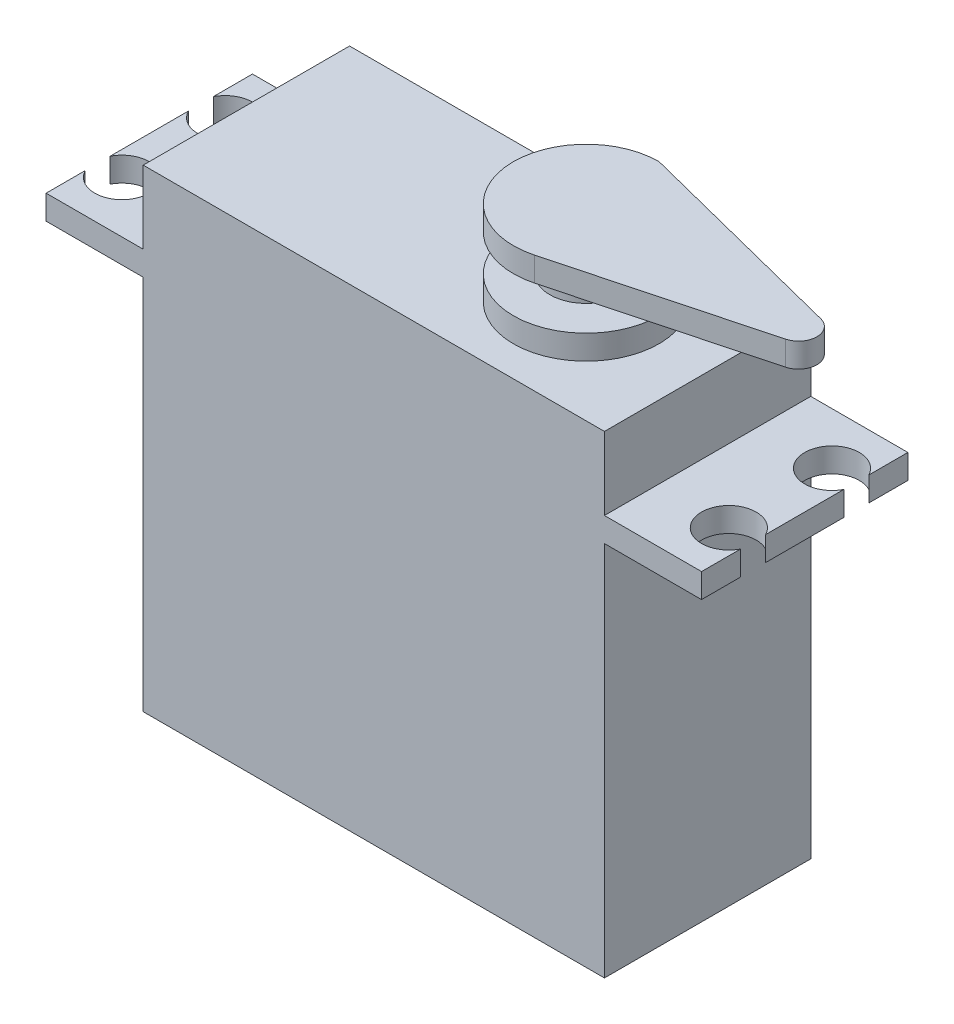
ISO-10303-21;
HEADER;
FILE_DESCRIPTION(('STEP AP214'),'2;1');
FILE_NAME('part.step','',(''),(''),'','','');
FILE_SCHEMA(('AUTOMOTIVE_DESIGN { 1 0 10303 214 1 1 1 1 }'));
ENDSEC;
DATA;
#1=APPLICATION_CONTEXT('core data for automotive mechanical design processes');
#2=APPLICATION_PROTOCOL_DEFINITION('international standard','automotive_design',2000,#1);
#3=PRODUCT_CONTEXT('',#1,'mechanical');
#4=PRODUCT('Part','Part','',(#3));
#5=PRODUCT_RELATED_PRODUCT_CATEGORY('part','',(#4));
#6=PRODUCT_DEFINITION_FORMATION('','',#4);
#7=PRODUCT_DEFINITION_CONTEXT('part definition',#1,'design');
#8=PRODUCT_DEFINITION('design','',#6,#7);
#9=PRODUCT_DEFINITION_SHAPE('','',#8);
#10=(LENGTH_UNIT() NAMED_UNIT(*) SI_UNIT(.MILLI.,.METRE.));
#11=(NAMED_UNIT(*) PLANE_ANGLE_UNIT() SI_UNIT($,.RADIAN.));
#12=(NAMED_UNIT(*) SI_UNIT($,.STERADIAN.) SOLID_ANGLE_UNIT());
#13=UNCERTAINTY_MEASURE_WITH_UNIT(LENGTH_MEASURE(1.E-05),#10,'distance_accuracy_value','');
#14=(GEOMETRIC_REPRESENTATION_CONTEXT(3) GLOBAL_UNCERTAINTY_ASSIGNED_CONTEXT((#13)) GLOBAL_UNIT_ASSIGNED_CONTEXT((#10,
#11,#12)) REPRESENTATION_CONTEXT('',''));
#15=CARTESIAN_POINT('',(0.,0.,0.));
#16=DIRECTION('',(0.,0.,1.));
#17=DIRECTION('',(1.,0.,0.));
#18=AXIS2_PLACEMENT_3D('',#15,#16,#17);
#19=CARTESIAN_POINT('',(-19.,39.,-8.5));
#20=DIRECTION('',(1.,0.,0.));
#21=DIRECTION('',(0.,0.,-1.));
#22=AXIS2_PLACEMENT_3D('',#19,#20,#21);
#23=PLANE('',#22);
#24=DIRECTION('',(0.,0.,1.));
#25=VECTOR('',#24,1.);
#26=CARTESIAN_POINT('',(-19.,31.,-8.50000000000001));
#27=LINE('',#26,#25);
#28=CARTESIAN_POINT('',(-19.,31.,-8.50000000000001));
#29=VERTEX_POINT('',#28);
#30=CARTESIAN_POINT('',(-19.,31.,8.5));
#31=VERTEX_POINT('',#30);
#32=EDGE_CURVE('E233',#29,#31,#27,.T.);
#33=ORIENTED_EDGE('',*,*,#32,.F.);
#34=DIRECTION('',(0.,-1.,0.));
#35=VECTOR('',#34,1.);
#36=CARTESIAN_POINT('',(-19.,39.,-8.5));
#37=LINE('',#36,#35);
#38=CARTESIAN_POINT('',(-19.,0.,-8.5));
#39=VERTEX_POINT('',#38);
#40=EDGE_CURVE('E353',#29,#39,#37,.T.);
#41=ORIENTED_EDGE('',*,*,#40,.T.);
#42=DIRECTION('',(0.,0.,1.));
#43=VECTOR('',#42,1.);
#44=CARTESIAN_POINT('',(-19.,0.,-8.5));
#45=LINE('',#44,#43);
#46=CARTESIAN_POINT('',(-19.,0.,8.5));
#47=VERTEX_POINT('',#46);
#48=EDGE_CURVE('E342',#39,#47,#45,.T.);
#49=ORIENTED_EDGE('',*,*,#48,.T.);
#50=DIRECTION('',(0.,-1.,0.));
#51=VECTOR('',#50,1.);
#52=CARTESIAN_POINT('',(-19.,39.,8.5));
#53=LINE('',#52,#51);
#54=EDGE_CURVE('E372',#31,#47,#53,.T.);
#55=ORIENTED_EDGE('',*,*,#54,.F.);
#56=EDGE_LOOP('',(#33,#41,#49,#55));
#57=FACE_BOUND('',#56,.T.);
#58=ADVANCED_FACE('F33',(#57),#23,.F.);
#59=CARTESIAN_POINT('',(19.,39.,-8.50000000000001));
#60=DIRECTION('',(-1.,0.,0.));
#61=DIRECTION('',(0.,0.,1.));
#62=AXIS2_PLACEMENT_3D('',#59,#60,#61);
#63=PLANE('',#62);
#64=DIRECTION('',(0.,0.,1.));
#65=VECTOR('',#64,1.);
#66=CARTESIAN_POINT('',(19.,33.,-8.50000000000001));
#67=LINE('',#66,#65);
#68=CARTESIAN_POINT('',(19.,33.,-8.50000000000001));
#69=VERTEX_POINT('',#68);
#70=CARTESIAN_POINT('',(19.,33.,8.5));
#71=VERTEX_POINT('',#70);
#72=EDGE_CURVE('E290',#69,#71,#67,.T.);
#73=ORIENTED_EDGE('',*,*,#72,.F.);
#74=DIRECTION('',(0.,-1.,0.));
#75=VECTOR('',#74,1.);
#76=CARTESIAN_POINT('',(19.,39.,-8.50000000000001));
#77=LINE('',#76,#75);
#78=CARTESIAN_POINT('',(19.,39.,-8.50000000000001));
#79=VERTEX_POINT('',#78);
#80=EDGE_CURVE('E368',#79,#69,#77,.T.);
#81=ORIENTED_EDGE('',*,*,#80,.F.);
#82=DIRECTION('',(0.,0.,-1.));
#83=VECTOR('',#82,1.);
#84=CARTESIAN_POINT('',(19.,39.,-8.50000000000001));
#85=LINE('',#84,#83);
#86=CARTESIAN_POINT('',(19.,39.,8.49999999999999));
#87=VERTEX_POINT('',#86);
#88=EDGE_CURVE('E349',#87,#79,#85,.T.);
#89=ORIENTED_EDGE('',*,*,#88,.F.);
#90=DIRECTION('',(0.,-1.,0.));
#91=VECTOR('',#90,1.);
#92=CARTESIAN_POINT('',(19.,39.,8.49999999999999));
#93=LINE('',#92,#91);
#94=EDGE_CURVE('E371',#87,#71,#93,.T.);
#95=ORIENTED_EDGE('',*,*,#94,.T.);
#96=EDGE_LOOP('',(#73,#81,#89,#95));
#97=FACE_BOUND('',#96,.T.);
#98=ADVANCED_FACE('F412',(#97),#63,.F.);
#99=CARTESIAN_POINT('',(-19.,39.,-8.5));
#100=VERTEX_POINT('',#99);
#101=CARTESIAN_POINT('',(-19.,33.,-8.50000000000001));
#102=VERTEX_POINT('',#101);
#103=EDGE_CURVE('E364',#100,#102,#37,.T.);
#104=ORIENTED_EDGE('',*,*,#103,.T.);
#105=DIRECTION('',(0.,0.,1.));
#106=VECTOR('',#105,1.);
#107=CARTESIAN_POINT('',(-19.,33.,-8.50000000000001));
#108=LINE('',#107,#106);
#109=CARTESIAN_POINT('',(-19.,33.,8.5));
#110=VERTEX_POINT('',#109);
#111=EDGE_CURVE('E236',#102,#110,#108,.T.);
#112=ORIENTED_EDGE('',*,*,#111,.T.);
#113=CARTESIAN_POINT('',(-19.,39.,8.5));
#114=VERTEX_POINT('',#113);
#115=EDGE_CURVE('E37',#114,#110,#53,.T.);
#116=ORIENTED_EDGE('',*,*,#115,.F.);
#117=DIRECTION('',(0.,0.,1.));
#118=VECTOR('',#117,1.);
#119=CARTESIAN_POINT('',(-19.,39.,-8.5));
#120=LINE('',#119,#118);
#121=EDGE_CURVE('E343',#100,#114,#120,.T.);
#122=ORIENTED_EDGE('',*,*,#121,.F.);
#123=EDGE_LOOP('',(#104,#112,#116,#122));
#124=FACE_BOUND('',#123,.T.);
#125=ADVANCED_FACE('F35',(#124),#23,.F.);
#126=CARTESIAN_POINT('',(-19.,39.,8.5));
#127=DIRECTION('',(0.,0.,-1.));
#128=DIRECTION('',(-1.,0.,0.));
#129=AXIS2_PLACEMENT_3D('',#126,#127,#128);
#130=PLANE('',#129);
#131=DIRECTION('',(1.,0.,0.));
#132=VECTOR('',#131,1.);
#133=CARTESIAN_POINT('',(-19.,0.,8.5));
#134=LINE('',#133,#132);
#135=CARTESIAN_POINT('',(19.,0.,8.49999999999999));
#136=VERTEX_POINT('',#135);
#137=EDGE_CURVE('E356',#47,#136,#134,.T.);
#138=ORIENTED_EDGE('',*,*,#137,.T.);
#139=CARTESIAN_POINT('',(19.,31.,8.49999999999999));
#140=VERTEX_POINT('',#139);
#141=EDGE_CURVE('E370',#140,#136,#93,.T.);
#142=ORIENTED_EDGE('',*,*,#141,.F.);
#143=DIRECTION('',(1.,0.,0.));
#144=VECTOR('',#143,1.);
#145=CARTESIAN_POINT('',(19.,31.,8.5));
#146=LINE('',#145,#144);
#147=CARTESIAN_POINT('',(27.,31.,8.5));
#148=VERTEX_POINT('',#147);
#149=EDGE_CURVE('E311',#140,#148,#146,.T.);
#150=ORIENTED_EDGE('',*,*,#149,.T.);
#151=DIRECTION('',(0.,-1.,0.));
#152=VECTOR('',#151,1.);
#153=CARTESIAN_POINT('',(27.,33.,8.5));
#154=LINE('',#153,#152);
#155=CARTESIAN_POINT('',(27.,33.,8.5));
#156=VERTEX_POINT('',#155);
#157=EDGE_CURVE('E339',#156,#148,#154,.T.);
#158=ORIENTED_EDGE('',*,*,#157,.F.);
#159=DIRECTION('',(1.,0.,0.));
#160=VECTOR('',#159,1.);
#161=CARTESIAN_POINT('',(19.,33.,8.5));
#162=LINE('',#161,#160);
#163=EDGE_CURVE('E293',#71,#156,#162,.T.);
#164=ORIENTED_EDGE('',*,*,#163,.F.);
#165=ORIENTED_EDGE('',*,*,#94,.F.);
#166=DIRECTION('',(1.,0.,0.));
#167=VECTOR('',#166,1.);
#168=CARTESIAN_POINT('',(-19.,39.,8.5));
#169=LINE('',#168,#167);
#170=EDGE_CURVE('E346',#114,#87,#169,.T.);
#171=ORIENTED_EDGE('',*,*,#170,.F.);
#172=ORIENTED_EDGE('',*,*,#115,.T.);
#173=DIRECTION('',(-1.,0.,0.));
#174=VECTOR('',#173,1.);
#175=CARTESIAN_POINT('',(-19.,33.,8.5));
#176=LINE('',#175,#174);
#177=CARTESIAN_POINT('',(-27.,33.,8.5));
#178=VERTEX_POINT('',#177);
#179=EDGE_CURVE('E49',#110,#178,#176,.T.);
#180=ORIENTED_EDGE('',*,*,#179,.T.);
#181=DIRECTION('',(0.,-1.,0.));
#182=VECTOR('',#181,1.);
#183=CARTESIAN_POINT('',(-27.,33.,8.5));
#184=LINE('',#183,#182);
#185=CARTESIAN_POINT('',(-27.,31.,8.5));
#186=VERTEX_POINT('',#185);
#187=EDGE_CURVE('E258',#178,#186,#184,.T.);
#188=ORIENTED_EDGE('',*,*,#187,.T.);
#189=DIRECTION('',(-1.,0.,0.));
#190=VECTOR('',#189,1.);
#191=CARTESIAN_POINT('',(-19.,31.,8.5));
#192=LINE('',#191,#190);
#193=EDGE_CURVE('E239',#31,#186,#192,.T.);
#194=ORIENTED_EDGE('',*,*,#193,.F.);
#195=ORIENTED_EDGE('',*,*,#54,.T.);
#196=EDGE_LOOP('',(#138,#142,#150,#158,#164,#165,#171,#172,#180,#188,#194,#195));
#197=FACE_BOUND('',#196,.T.);
#198=ADVANCED_FACE('F383',(#197),#130,.F.);
#199=CARTESIAN_POINT('',(19.,31.,-8.50000000000001));
#200=VERTEX_POINT('',#199);
#201=CARTESIAN_POINT('',(19.,0.,-8.50000000000001));
#202=VERTEX_POINT('',#201);
#203=EDGE_CURVE('E367',#200,#202,#77,.T.);
#204=ORIENTED_EDGE('',*,*,#203,.F.);
#205=DIRECTION('',(0.,0.,1.));
#206=VECTOR('',#205,1.);
#207=CARTESIAN_POINT('',(19.,31.,-8.50000000000001));
#208=LINE('',#207,#206);
#209=EDGE_CURVE('E57',#200,#140,#208,.T.);
#210=ORIENTED_EDGE('',*,*,#209,.T.);
#211=ORIENTED_EDGE('',*,*,#141,.T.);
#212=DIRECTION('',(0.,0.,-1.));
#213=VECTOR('',#212,1.);
#214=CARTESIAN_POINT('',(19.,0.,-8.50000000000001));
#215=LINE('',#214,#213);
#216=EDGE_CURVE('E359',#136,#202,#215,.T.);
#217=ORIENTED_EDGE('',*,*,#216,.T.);
#218=EDGE_LOOP('',(#204,#210,#211,#217));
#219=FACE_BOUND('',#218,.T.);
#220=ADVANCED_FACE('F377',(#219),#63,.F.);
#221=CARTESIAN_POINT('',(-19.,39.,-8.5));
#222=DIRECTION('',(0.,0.,1.));
#223=DIRECTION('',(1.,0.,0.));
#224=AXIS2_PLACEMENT_3D('',#221,#222,#223);
#225=PLANE('',#224);
#226=DIRECTION('',(-1.,0.,0.));
#227=VECTOR('',#226,1.);
#228=CARTESIAN_POINT('',(-19.,0.,-8.5));
#229=LINE('',#228,#227);
#230=EDGE_CURVE('E347',#202,#39,#229,.T.);
#231=ORIENTED_EDGE('',*,*,#230,.T.);
#232=ORIENTED_EDGE('',*,*,#40,.F.);
#233=DIRECTION('',(1.,0.,0.));
#234=VECTOR('',#233,1.);
#235=CARTESIAN_POINT('',(-19.,31.,-8.50000000000001));
#236=LINE('',#235,#234);
#237=CARTESIAN_POINT('',(-27.,31.,-8.50000000000001));
#238=VERTEX_POINT('',#237);
#239=EDGE_CURVE('E260',#238,#29,#236,.T.);
#240=ORIENTED_EDGE('',*,*,#239,.F.);
#241=DIRECTION('',(0.,-1.,0.));
#242=VECTOR('',#241,1.);
#243=CARTESIAN_POINT('',(-27.,33.,-8.50000000000001));
#244=LINE('',#243,#242);
#245=CARTESIAN_POINT('',(-27.,33.,-8.50000000000001));
#246=VERTEX_POINT('',#245);
#247=EDGE_CURVE('E288',#246,#238,#244,.T.);
#248=ORIENTED_EDGE('',*,*,#247,.F.);
#249=DIRECTION('',(1.,0.,0.));
#250=VECTOR('',#249,1.);
#251=CARTESIAN_POINT('',(-19.,33.,-8.50000000000001));
#252=LINE('',#251,#250);
#253=EDGE_CURVE('E238',#246,#102,#252,.T.);
#254=ORIENTED_EDGE('',*,*,#253,.T.);
#255=ORIENTED_EDGE('',*,*,#103,.F.);
#256=DIRECTION('',(-1.,0.,0.));
#257=VECTOR('',#256,1.);
#258=CARTESIAN_POINT('',(-19.,39.,-8.5));
#259=LINE('',#258,#257);
#260=EDGE_CURVE('E351',#79,#100,#259,.T.);
#261=ORIENTED_EDGE('',*,*,#260,.F.);
#262=ORIENTED_EDGE('',*,*,#80,.T.);
#263=DIRECTION('',(-1.,0.,0.));
#264=VECTOR('',#263,1.);
#265=CARTESIAN_POINT('',(19.,33.,-8.50000000000001));
#266=LINE('',#265,#264);
#267=CARTESIAN_POINT('',(27.,33.,-8.50000000000001));
#268=VERTEX_POINT('',#267);
#269=EDGE_CURVE('E306',#268,#69,#266,.T.);
#270=ORIENTED_EDGE('',*,*,#269,.F.);
#271=DIRECTION('',(0.,-1.,0.));
#272=VECTOR('',#271,1.);
#273=CARTESIAN_POINT('',(27.,33.,-8.50000000000001));
#274=LINE('',#273,#272);
#275=CARTESIAN_POINT('',(27.,31.,-8.50000000000001));
#276=VERTEX_POINT('',#275);
#277=EDGE_CURVE('E309',#268,#276,#274,.T.);
#278=ORIENTED_EDGE('',*,*,#277,.T.);
#279=DIRECTION('',(-1.,0.,0.));
#280=VECTOR('',#279,1.);
#281=CARTESIAN_POINT('',(19.,31.,-8.50000000000001));
#282=LINE('',#281,#280);
#283=EDGE_CURVE('E294',#276,#200,#282,.T.);
#284=ORIENTED_EDGE('',*,*,#283,.T.);
#285=ORIENTED_EDGE('',*,*,#203,.T.);
#286=EDGE_LOOP('',(#231,#232,#240,#248,#254,#255,#261,#262,#270,#278,#284,#285));
#287=FACE_BOUND('',#286,.T.);
#288=ADVANCED_FACE('F391',(#287),#225,.F.);
#289=CARTESIAN_POINT('',(0.,39.,0.));
#290=DIRECTION('',(0.,1.,0.));
#291=DIRECTION('',(0.,0.,1.));
#292=AXIS2_PLACEMENT_3D('',#289,#290,#291);
#293=PLANE('',#292);
#294=CARTESIAN_POINT('',(9.00000000000001,39.,0.));
#295=DIRECTION('',(0.,1.,0.));
#296=DIRECTION('',(0.,0.,1.));
#297=AXIS2_PLACEMENT_3D('',#294,#295,#296);
#298=CIRCLE('',#297,6.);
#299=CARTESIAN_POINT('',(9.00000000000001,39.,6.));
#300=VERTEX_POINT('',#299);
#301=EDGE_CURVE('E224',#300,#300,#298,.T.);
#302=ORIENTED_EDGE('',*,*,#301,.F.);
#303=EDGE_LOOP('',(#302));
#304=FACE_BOUND('',#303,.T.);
#305=ORIENTED_EDGE('',*,*,#121,.T.);
#306=ORIENTED_EDGE('',*,*,#170,.T.);
#307=ORIENTED_EDGE('',*,*,#88,.T.);
#308=ORIENTED_EDGE('',*,*,#260,.T.);
#309=EDGE_LOOP('',(#305,#306,#307,#308));
#310=FACE_BOUND('',#309,.T.);
#311=ADVANCED_FACE('F415',(#304,#310),#293,.T.);
#312=CARTESIAN_POINT('',(0.,0.,0.));
#313=DIRECTION('',(0.,1.,0.));
#314=DIRECTION('',(0.,0.,1.));
#315=AXIS2_PLACEMENT_3D('',#312,#313,#314);
#316=PLANE('',#315);
#317=ORIENTED_EDGE('',*,*,#48,.F.);
#318=ORIENTED_EDGE('',*,*,#230,.F.);
#319=ORIENTED_EDGE('',*,*,#216,.F.);
#320=ORIENTED_EDGE('',*,*,#137,.F.);
#321=EDGE_LOOP('',(#317,#318,#319,#320));
#322=FACE_BOUND('',#321,.T.);
#323=ADVANCED_FACE('F388',(#322),#316,.F.);
#324=CARTESIAN_POINT('',(27.,33.,5.2807764064044));
#325=DIRECTION('',(-1.,0.,0.));
#326=DIRECTION('',(0.,0.,1.));
#327=AXIS2_PLACEMENT_3D('',#324,#325,#326);
#328=PLANE('',#327);
#329=DIRECTION('',(0.,0.,-1.));
#330=VECTOR('',#329,1.);
#331=CARTESIAN_POINT('',(27.,31.,5.2807764064044));
#332=LINE('',#331,#330);
#333=CARTESIAN_POINT('',(27.,31.,5.2807764064044));
#334=VERTEX_POINT('',#333);
#335=EDGE_CURVE('E313',#148,#334,#332,.T.);
#336=ORIENTED_EDGE('',*,*,#335,.T.);
#337=DIRECTION('',(0.,-1.,0.));
#338=VECTOR('',#337,1.);
#339=CARTESIAN_POINT('',(27.,33.,5.2807764064044));
#340=LINE('',#339,#338);
#341=CARTESIAN_POINT('',(27.,33.,5.2807764064044));
#342=VERTEX_POINT('',#341);
#343=EDGE_CURVE('E336',#342,#334,#340,.T.);
#344=ORIENTED_EDGE('',*,*,#343,.F.);
#345=DIRECTION('',(0.,0.,-1.));
#346=VECTOR('',#345,1.);
#347=CARTESIAN_POINT('',(27.,33.,5.2807764064044));
#348=LINE('',#347,#346);
#349=EDGE_CURVE('E296',#156,#342,#348,.T.);
#350=ORIENTED_EDGE('',*,*,#349,.F.);
#351=ORIENTED_EDGE('',*,*,#157,.T.);
#352=EDGE_LOOP('',(#336,#344,#350,#351));
#353=FACE_BOUND('',#352,.T.);
#354=ADVANCED_FACE('F404',(#353),#328,.F.);
#355=CARTESIAN_POINT('',(25.,33.,4.25));
#356=DIRECTION('',(0.,-1.,0.));
#357=DIRECTION('',(0.,0.,-1.));
#358=AXIS2_PLACEMENT_3D('',#355,#356,#357);
#359=CYLINDRICAL_SURFACE('',#358,2.25);
#360=CARTESIAN_POINT('',(25.,31.,4.25));
#361=DIRECTION('',(0.,-1.,0.));
#362=DIRECTION('',(0.,0.,-1.));
#363=AXIS2_PLACEMENT_3D('',#360,#361,#362);
#364=CIRCLE('',#363,2.25);
#365=CARTESIAN_POINT('',(27.,31.,3.2192235935956));
#366=VERTEX_POINT('',#365);
#367=EDGE_CURVE('E315',#334,#366,#364,.T.);
#368=ORIENTED_EDGE('',*,*,#367,.T.);
#369=DIRECTION('',(0.,-1.,0.));
#370=VECTOR('',#369,1.);
#371=CARTESIAN_POINT('',(27.,33.,3.2192235935956));
#372=LINE('',#371,#370);
#373=CARTESIAN_POINT('',(27.,33.,3.2192235935956));
#374=VERTEX_POINT('',#373);
#375=EDGE_CURVE('E333',#374,#366,#372,.T.);
#376=ORIENTED_EDGE('',*,*,#375,.F.);
#377=CARTESIAN_POINT('',(25.,33.,4.25));
#378=DIRECTION('',(0.,-1.,0.));
#379=DIRECTION('',(0.,0.,-1.));
#380=AXIS2_PLACEMENT_3D('',#377,#378,#379);
#381=CIRCLE('',#380,2.25);
#382=EDGE_CURVE('E298',#342,#374,#381,.T.);
#383=ORIENTED_EDGE('',*,*,#382,.F.);
#384=ORIENTED_EDGE('',*,*,#343,.T.);
#385=EDGE_LOOP('',(#368,#376,#383,#384));
#386=FACE_BOUND('',#385,.T.);
#387=ADVANCED_FACE('F450',(#386),#359,.F.);
#388=CARTESIAN_POINT('',(27.,33.,-3.2192235935956));
#389=DIRECTION('',(-1.,0.,0.));
#390=DIRECTION('',(0.,0.,1.));
#391=AXIS2_PLACEMENT_3D('',#388,#389,#390);
#392=PLANE('',#391);
#393=DIRECTION('',(0.,0.,-1.));
#394=VECTOR('',#393,1.);
#395=CARTESIAN_POINT('',(27.,31.,-3.2192235935956));
#396=LINE('',#395,#394);
#397=CARTESIAN_POINT('',(27.,31.,-3.2192235935956));
#398=VERTEX_POINT('',#397);
#399=EDGE_CURVE('E317',#366,#398,#396,.T.);
#400=ORIENTED_EDGE('',*,*,#399,.T.);
#401=DIRECTION('',(0.,-1.,0.));
#402=VECTOR('',#401,1.);
#403=CARTESIAN_POINT('',(27.,33.,-3.2192235935956));
#404=LINE('',#403,#402);
#405=CARTESIAN_POINT('',(27.,33.,-3.2192235935956));
#406=VERTEX_POINT('',#405);
#407=EDGE_CURVE('E330',#406,#398,#404,.T.);
#408=ORIENTED_EDGE('',*,*,#407,.F.);
#409=DIRECTION('',(0.,0.,-1.));
#410=VECTOR('',#409,1.);
#411=CARTESIAN_POINT('',(27.,33.,-3.2192235935956));
#412=LINE('',#411,#410);
#413=EDGE_CURVE('E300',#374,#406,#412,.T.);
#414=ORIENTED_EDGE('',*,*,#413,.F.);
#415=ORIENTED_EDGE('',*,*,#375,.T.);
#416=EDGE_LOOP('',(#400,#408,#414,#415));
#417=FACE_BOUND('',#416,.T.);
#418=ADVANCED_FACE('F453',(#417),#392,.F.);
#419=CARTESIAN_POINT('',(25.,33.,-4.25));
#420=DIRECTION('',(0.,-1.,0.));
#421=DIRECTION('',(0.,0.,-1.));
#422=AXIS2_PLACEMENT_3D('',#419,#420,#421);
#423=CYLINDRICAL_SURFACE('',#422,2.25);
#424=CARTESIAN_POINT('',(25.,31.,-4.25));
#425=DIRECTION('',(0.,-1.,0.));
#426=DIRECTION('',(0.,0.,1.));
#427=AXIS2_PLACEMENT_3D('',#424,#425,#426);
#428=CIRCLE('',#427,2.25);
#429=CARTESIAN_POINT('',(27.,31.,-5.2807764064044));
#430=VERTEX_POINT('',#429);
#431=EDGE_CURVE('E319',#398,#430,#428,.T.);
#432=ORIENTED_EDGE('',*,*,#431,.T.);
#433=DIRECTION('',(0.,-1.,0.));
#434=VECTOR('',#433,1.);
#435=CARTESIAN_POINT('',(27.,33.,-5.2807764064044));
#436=LINE('',#435,#434);
#437=CARTESIAN_POINT('',(27.,33.,-5.2807764064044));
#438=VERTEX_POINT('',#437);
#439=EDGE_CURVE('E327',#438,#430,#436,.T.);
#440=ORIENTED_EDGE('',*,*,#439,.F.);
#441=CARTESIAN_POINT('',(25.,33.,-4.25));
#442=DIRECTION('',(0.,-1.,0.));
#443=DIRECTION('',(0.,0.,1.));
#444=AXIS2_PLACEMENT_3D('',#441,#442,#443);
#445=CIRCLE('',#444,2.25);
#446=EDGE_CURVE('E302',#406,#438,#445,.T.);
#447=ORIENTED_EDGE('',*,*,#446,.F.);
#448=ORIENTED_EDGE('',*,*,#407,.T.);
#449=EDGE_LOOP('',(#432,#440,#447,#448));
#450=FACE_BOUND('',#449,.T.);
#451=ADVANCED_FACE('F457',(#450),#423,.F.);
#452=CARTESIAN_POINT('',(27.,33.,-8.50000000000001));
#453=DIRECTION('',(-1.,0.,0.));
#454=DIRECTION('',(0.,0.,1.));
#455=AXIS2_PLACEMENT_3D('',#452,#453,#454);
#456=PLANE('',#455);
#457=DIRECTION('',(0.,0.,-1.));
#458=VECTOR('',#457,1.);
#459=CARTESIAN_POINT('',(27.,31.,-8.50000000000001));
#460=LINE('',#459,#458);
#461=EDGE_CURVE('E321',#430,#276,#460,.T.);
#462=ORIENTED_EDGE('',*,*,#461,.T.);
#463=ORIENTED_EDGE('',*,*,#277,.F.);
#464=DIRECTION('',(0.,0.,-1.));
#465=VECTOR('',#464,1.);
#466=CARTESIAN_POINT('',(27.,33.,-8.50000000000001));
#467=LINE('',#466,#465);
#468=EDGE_CURVE('E304',#438,#268,#467,.T.);
#469=ORIENTED_EDGE('',*,*,#468,.F.);
#470=ORIENTED_EDGE('',*,*,#439,.T.);
#471=EDGE_LOOP('',(#462,#463,#469,#470));
#472=FACE_BOUND('',#471,.T.);
#473=ADVANCED_FACE('F461',(#472),#456,.F.);
#474=CARTESIAN_POINT('',(25.,33.,4.25));
#475=DIRECTION('',(0.,-1.,0.));
#476=DIRECTION('',(0.,0.,-1.));
#477=AXIS2_PLACEMENT_3D('',#474,#475,#476);
#478=PLANE('',#477);
#479=ORIENTED_EDGE('',*,*,#72,.T.);
#480=ORIENTED_EDGE('',*,*,#163,.T.);
#481=ORIENTED_EDGE('',*,*,#349,.T.);
#482=ORIENTED_EDGE('',*,*,#382,.T.);
#483=ORIENTED_EDGE('',*,*,#413,.T.);
#484=ORIENTED_EDGE('',*,*,#446,.T.);
#485=ORIENTED_EDGE('',*,*,#468,.T.);
#486=ORIENTED_EDGE('',*,*,#269,.T.);
#487=EDGE_LOOP('',(#479,#480,#481,#482,#483,#484,#485,#486));
#488=FACE_BOUND('',#487,.T.);
#489=ADVANCED_FACE('F408',(#488),#478,.F.);
#490=CARTESIAN_POINT('',(25.,31.,4.25));
#491=DIRECTION('',(0.,-1.,0.));
#492=DIRECTION('',(0.,0.,-1.));
#493=AXIS2_PLACEMENT_3D('',#490,#491,#492);
#494=PLANE('',#493);
#495=ORIENTED_EDGE('',*,*,#209,.F.);
#496=ORIENTED_EDGE('',*,*,#283,.F.);
#497=ORIENTED_EDGE('',*,*,#461,.F.);
#498=ORIENTED_EDGE('',*,*,#431,.F.);
#499=ORIENTED_EDGE('',*,*,#399,.F.);
#500=ORIENTED_EDGE('',*,*,#367,.F.);
#501=ORIENTED_EDGE('',*,*,#335,.F.);
#502=ORIENTED_EDGE('',*,*,#149,.F.);
#503=EDGE_LOOP('',(#495,#496,#497,#498,#499,#500,#501,#502));
#504=FACE_BOUND('',#503,.T.);
#505=ADVANCED_FACE('F398',(#504),#494,.T.);
#506=CARTESIAN_POINT('',(-27.,33.,-8.50000000000001));
#507=DIRECTION('',(-1.,0.,0.));
#508=DIRECTION('',(0.,0.,1.));
#509=AXIS2_PLACEMENT_3D('',#506,#507,#508);
#510=PLANE('',#509);
#511=DIRECTION('',(0.,0.,-1.));
#512=VECTOR('',#511,1.);
#513=CARTESIAN_POINT('',(-27.,31.,-8.50000000000001));
#514=LINE('',#513,#512);
#515=CARTESIAN_POINT('',(-27.,31.,-5.2807764064044));
#516=VERTEX_POINT('',#515);
#517=EDGE_CURVE('E262',#516,#238,#514,.T.);
#518=ORIENTED_EDGE('',*,*,#517,.F.);
#519=DIRECTION('',(0.,-1.,0.));
#520=VECTOR('',#519,1.);
#521=CARTESIAN_POINT('',(-27.,33.,-5.2807764064044));
#522=LINE('',#521,#520);
#523=CARTESIAN_POINT('',(-27.,33.,-5.2807764064044));
#524=VERTEX_POINT('',#523);
#525=EDGE_CURVE('E286',#524,#516,#522,.T.);
#526=ORIENTED_EDGE('',*,*,#525,.F.);
#527=DIRECTION('',(0.,0.,-1.));
#528=VECTOR('',#527,1.);
#529=CARTESIAN_POINT('',(-27.,33.,-8.50000000000001));
#530=LINE('',#529,#528);
#531=EDGE_CURVE('E242',#524,#246,#530,.T.);
#532=ORIENTED_EDGE('',*,*,#531,.T.);
#533=ORIENTED_EDGE('',*,*,#247,.T.);
#534=EDGE_LOOP('',(#518,#526,#532,#533));
#535=FACE_BOUND('',#534,.T.);
#536=ADVANCED_FACE('F468',(#535),#510,.T.);
#537=CARTESIAN_POINT('',(-25.,33.,-4.25));
#538=DIRECTION('',(0.,-1.,0.));
#539=DIRECTION('',(0.,0.,-1.));
#540=AXIS2_PLACEMENT_3D('',#537,#538,#539);
#541=CYLINDRICAL_SURFACE('',#540,2.25);
#542=CARTESIAN_POINT('',(-25.,31.,-4.25));
#543=DIRECTION('',(0.,1.,0.));
#544=DIRECTION('',(0.,0.,1.));
#545=AXIS2_PLACEMENT_3D('',#542,#543,#544);
#546=CIRCLE('',#545,2.25);
#547=CARTESIAN_POINT('',(-27.,31.,-3.2192235935956));
#548=VERTEX_POINT('',#547);
#549=EDGE_CURVE('E265',#548,#516,#546,.T.);
#550=ORIENTED_EDGE('',*,*,#549,.F.);
#551=DIRECTION('',(0.,-1.,0.));
#552=VECTOR('',#551,1.);
#553=CARTESIAN_POINT('',(-27.,33.,-3.2192235935956));
#554=LINE('',#553,#552);
#555=CARTESIAN_POINT('',(-27.,33.,-3.2192235935956));
#556=VERTEX_POINT('',#555);
#557=EDGE_CURVE('E284',#556,#548,#554,.T.);
#558=ORIENTED_EDGE('',*,*,#557,.F.);
#559=CARTESIAN_POINT('',(-25.,33.,-4.25));
#560=DIRECTION('',(0.,1.,0.));
#561=DIRECTION('',(0.,0.,1.));
#562=AXIS2_PLACEMENT_3D('',#559,#560,#561);
#563=CIRCLE('',#562,2.25);
#564=EDGE_CURVE('E245',#556,#524,#563,.T.);
#565=ORIENTED_EDGE('',*,*,#564,.T.);
#566=ORIENTED_EDGE('',*,*,#525,.T.);
#567=EDGE_LOOP('',(#550,#558,#565,#566));
#568=FACE_BOUND('',#567,.T.);
#569=ADVANCED_FACE('F473',(#568),#541,.F.);
#570=CARTESIAN_POINT('',(-27.,33.,-3.2192235935956));
#571=DIRECTION('',(-1.,0.,0.));
#572=DIRECTION('',(0.,0.,1.));
#573=AXIS2_PLACEMENT_3D('',#570,#571,#572);
#574=PLANE('',#573);
#575=DIRECTION('',(0.,0.,-1.));
#576=VECTOR('',#575,1.);
#577=CARTESIAN_POINT('',(-27.,31.,-3.2192235935956));
#578=LINE('',#577,#576);
#579=CARTESIAN_POINT('',(-27.,31.,3.2192235935956));
#580=VERTEX_POINT('',#579);
#581=EDGE_CURVE('E268',#580,#548,#578,.T.);
#582=ORIENTED_EDGE('',*,*,#581,.F.);
#583=DIRECTION('',(0.,-1.,0.));
#584=VECTOR('',#583,1.);
#585=CARTESIAN_POINT('',(-27.,33.,3.2192235935956));
#586=LINE('',#585,#584);
#587=CARTESIAN_POINT('',(-27.,33.,3.2192235935956));
#588=VERTEX_POINT('',#587);
#589=EDGE_CURVE('E282',#588,#580,#586,.T.);
#590=ORIENTED_EDGE('',*,*,#589,.F.);
#591=DIRECTION('',(0.,0.,-1.));
#592=VECTOR('',#591,1.);
#593=CARTESIAN_POINT('',(-27.,33.,-3.2192235935956));
#594=LINE('',#593,#592);
#595=EDGE_CURVE('E248',#588,#556,#594,.T.);
#596=ORIENTED_EDGE('',*,*,#595,.T.);
#597=ORIENTED_EDGE('',*,*,#557,.T.);
#598=EDGE_LOOP('',(#582,#590,#596,#597));
#599=FACE_BOUND('',#598,.T.);
#600=ADVANCED_FACE('F477',(#599),#574,.T.);
#601=CARTESIAN_POINT('',(-25.,33.,4.25));
#602=DIRECTION('',(0.,-1.,0.));
#603=DIRECTION('',(0.,0.,-1.));
#604=AXIS2_PLACEMENT_3D('',#601,#602,#603);
#605=CYLINDRICAL_SURFACE('',#604,2.25);
#606=CARTESIAN_POINT('',(-25.,31.,4.25));
#607=DIRECTION('',(0.,1.,0.));
#608=DIRECTION('',(0.,0.,-1.));
#609=AXIS2_PLACEMENT_3D('',#606,#607,#608);
#610=CIRCLE('',#609,2.25);
#611=CARTESIAN_POINT('',(-27.,31.,5.2807764064044));
#612=VERTEX_POINT('',#611);
#613=EDGE_CURVE('E271',#612,#580,#610,.T.);
#614=ORIENTED_EDGE('',*,*,#613,.F.);
#615=DIRECTION('',(0.,-1.,0.));
#616=VECTOR('',#615,1.);
#617=CARTESIAN_POINT('',(-27.,33.,5.2807764064044));
#618=LINE('',#617,#616);
#619=CARTESIAN_POINT('',(-27.,33.,5.2807764064044));
#620=VERTEX_POINT('',#619);
#621=EDGE_CURVE('E280',#620,#612,#618,.T.);
#622=ORIENTED_EDGE('',*,*,#621,.F.);
#623=CARTESIAN_POINT('',(-25.,33.,4.25));
#624=DIRECTION('',(0.,1.,0.));
#625=DIRECTION('',(0.,0.,-1.));
#626=AXIS2_PLACEMENT_3D('',#623,#624,#625);
#627=CIRCLE('',#626,2.25);
#628=EDGE_CURVE('E251',#620,#588,#627,.T.);
#629=ORIENTED_EDGE('',*,*,#628,.T.);
#630=ORIENTED_EDGE('',*,*,#589,.T.);
#631=EDGE_LOOP('',(#614,#622,#629,#630));
#632=FACE_BOUND('',#631,.T.);
#633=ADVANCED_FACE('F481',(#632),#605,.F.);
#634=CARTESIAN_POINT('',(-27.,33.,5.2807764064044));
#635=DIRECTION('',(-1.,0.,0.));
#636=DIRECTION('',(0.,0.,1.));
#637=AXIS2_PLACEMENT_3D('',#634,#635,#636);
#638=PLANE('',#637);
#639=DIRECTION('',(0.,0.,-1.));
#640=VECTOR('',#639,1.);
#641=CARTESIAN_POINT('',(-27.,31.,5.2807764064044));
#642=LINE('',#641,#640);
#643=EDGE_CURVE('E274',#186,#612,#642,.T.);
#644=ORIENTED_EDGE('',*,*,#643,.F.);
#645=ORIENTED_EDGE('',*,*,#187,.F.);
#646=DIRECTION('',(0.,0.,-1.));
#647=VECTOR('',#646,1.);
#648=CARTESIAN_POINT('',(-27.,33.,5.2807764064044));
#649=LINE('',#648,#647);
#650=EDGE_CURVE('E254',#178,#620,#649,.T.);
#651=ORIENTED_EDGE('',*,*,#650,.T.);
#652=ORIENTED_EDGE('',*,*,#621,.T.);
#653=EDGE_LOOP('',(#644,#645,#651,#652));
#654=FACE_BOUND('',#653,.T.);
#655=ADVANCED_FACE('F422',(#654),#638,.T.);
#656=CARTESIAN_POINT('',(-25.,33.,4.25));
#657=DIRECTION('',(0.,-1.,0.));
#658=DIRECTION('',(0.,0.,-1.));
#659=AXIS2_PLACEMENT_3D('',#656,#657,#658);
#660=PLANE('',#659);
#661=ORIENTED_EDGE('',*,*,#111,.F.);
#662=ORIENTED_EDGE('',*,*,#253,.F.);
#663=ORIENTED_EDGE('',*,*,#531,.F.);
#664=ORIENTED_EDGE('',*,*,#564,.F.);
#665=ORIENTED_EDGE('',*,*,#595,.F.);
#666=ORIENTED_EDGE('',*,*,#628,.F.);
#667=ORIENTED_EDGE('',*,*,#650,.F.);
#668=ORIENTED_EDGE('',*,*,#179,.F.);
#669=EDGE_LOOP('',(#661,#662,#663,#664,#665,#666,#667,#668));
#670=FACE_BOUND('',#669,.T.);
#671=ADVANCED_FACE('F488',(#670),#660,.F.);
#672=CARTESIAN_POINT('',(-25.,31.,4.25));
#673=DIRECTION('',(0.,-1.,0.));
#674=DIRECTION('',(0.,0.,-1.));
#675=AXIS2_PLACEMENT_3D('',#672,#673,#674);
#676=PLANE('',#675);
#677=ORIENTED_EDGE('',*,*,#32,.T.);
#678=ORIENTED_EDGE('',*,*,#193,.T.);
#679=ORIENTED_EDGE('',*,*,#643,.T.);
#680=ORIENTED_EDGE('',*,*,#613,.T.);
#681=ORIENTED_EDGE('',*,*,#581,.T.);
#682=ORIENTED_EDGE('',*,*,#549,.T.);
#683=ORIENTED_EDGE('',*,*,#517,.T.);
#684=ORIENTED_EDGE('',*,*,#239,.T.);
#685=EDGE_LOOP('',(#677,#678,#679,#680,#681,#682,#683,#684));
#686=FACE_BOUND('',#685,.T.);
#687=ADVANCED_FACE('F425',(#686),#676,.T.);
#688=CARTESIAN_POINT('',(9.00000000000001,41.,0.));
#689=DIRECTION('',(0.,-1.,0.));
#690=DIRECTION('',(0.,0.,-1.));
#691=AXIS2_PLACEMENT_3D('',#688,#689,#690);
#692=CYLINDRICAL_SURFACE('',#691,6.);
#693=CARTESIAN_POINT('',(9.00000000000001,41.,0.));
#694=DIRECTION('',(0.,1.,0.));
#695=DIRECTION('',(0.,0.,1.));
#696=AXIS2_PLACEMENT_3D('',#693,#694,#695);
#697=CIRCLE('',#696,6.);
#698=CARTESIAN_POINT('',(9.00000000000001,41.,6.));
#699=VERTEX_POINT('',#698);
#700=EDGE_CURVE('E230',#699,#699,#697,.T.);
#701=ORIENTED_EDGE('',*,*,#700,.F.);
#702=EDGE_LOOP('',(#701));
#703=FACE_BOUND('',#702,.T.);
#704=ORIENTED_EDGE('',*,*,#301,.T.);
#705=EDGE_LOOP('',(#704));
#706=FACE_BOUND('',#705,.T.);
#707=ADVANCED_FACE('F491',(#703,#706),#692,.T.);
#708=CARTESIAN_POINT('',(9.00000000000001,41.,0.));
#709=DIRECTION('',(0.,1.,0.));
#710=DIRECTION('',(0.,0.,1.));
#711=AXIS2_PLACEMENT_3D('',#708,#709,#710);
#712=PLANE('',#711);
#713=CARTESIAN_POINT('',(9.00000000000001,41.,0.));
#714=DIRECTION('',(0.,1.,0.));
#715=DIRECTION('',(0.,0.,1.));
#716=AXIS2_PLACEMENT_3D('',#713,#714,#715);
#717=CIRCLE('',#716,3.);
#718=CARTESIAN_POINT('',(9.00000000000001,41.,3.));
#719=VERTEX_POINT('',#718);
#720=EDGE_CURVE('E11',#719,#719,#717,.T.);
#721=ORIENTED_EDGE('',*,*,#720,.F.);
#722=EDGE_LOOP('',(#721));
#723=FACE_BOUND('',#722,.T.);
#724=ORIENTED_EDGE('',*,*,#700,.T.);
#725=EDGE_LOOP('',(#724));
#726=FACE_BOUND('',#725,.T.);
#727=ADVANCED_FACE('F496',(#723,#726),#712,.T.);
#728=CARTESIAN_POINT('',(9.00000000000001,44.,0.));
#729=DIRECTION('',(0.,-1.,0.));
#730=DIRECTION('',(0.,0.,-1.));
#731=AXIS2_PLACEMENT_3D('',#728,#729,#730);
#732=CYLINDRICAL_SURFACE('',#731,3.);
#733=CARTESIAN_POINT('',(9.00000000000001,44.,0.));
#734=DIRECTION('',(0.,1.,0.));
#735=DIRECTION('',(0.,0.,1.));
#736=AXIS2_PLACEMENT_3D('',#733,#734,#735);
#737=CIRCLE('',#736,3.);
#738=CARTESIAN_POINT('',(9.00000000000001,44.,3.));
#739=VERTEX_POINT('',#738);
#740=EDGE_CURVE('E221',#739,#739,#737,.T.);
#741=ORIENTED_EDGE('',*,*,#740,.F.);
#742=EDGE_LOOP('',(#741));
#743=FACE_BOUND('',#742,.T.);
#744=ORIENTED_EDGE('',*,*,#720,.T.);
#745=EDGE_LOOP('',(#744));
#746=FACE_BOUND('',#745,.T.);
#747=ADVANCED_FACE('F500',(#743,#746),#732,.T.);
#748=CARTESIAN_POINT('',(9.00000000000001,46.,0.));
#749=DIRECTION('',(0.,-1.,0.));
#750=DIRECTION('',(0.,0.,-1.));
#751=AXIS2_PLACEMENT_3D('',#748,#749,#750);
#752=CYLINDRICAL_SURFACE('',#751,6.);
#753=CARTESIAN_POINT('',(9.00000000000001,44.,0.));
#754=DIRECTION('',(0.,1.,0.));
#755=DIRECTION('',(0.,0.,1.));
#756=AXIS2_PLACEMENT_3D('',#753,#754,#755);
#757=CIRCLE('',#756,6.);
#758=CARTESIAN_POINT('',(9.00000000000001,44.,-6.));
#759=VERTEX_POINT('',#758);
#760=CARTESIAN_POINT('',(10.5428571428571,44.,5.79824040867009));
#761=VERTEX_POINT('',#760);
#762=EDGE_CURVE('E220',#759,#761,#757,.T.);
#763=ORIENTED_EDGE('',*,*,#762,.T.);
#764=DIRECTION('',(0.,-1.,0.));
#765=VECTOR('',#764,1.);
#766=CARTESIAN_POINT('',(10.5428571428571,46.,5.79824040867009));
#767=LINE('',#766,#765);
#768=CARTESIAN_POINT('',(10.5428571428571,46.,5.79824040867009));
#769=VERTEX_POINT('',#768);
#770=EDGE_CURVE('E200',#769,#761,#767,.T.);
#771=ORIENTED_EDGE('',*,*,#770,.F.);
#772=CARTESIAN_POINT('',(9.00000000000001,46.,0.));
#773=DIRECTION('',(0.,1.,0.));
#774=DIRECTION('',(0.,0.,1.));
#775=AXIS2_PLACEMENT_3D('',#772,#773,#774);
#776=CIRCLE('',#775,6.);
#777=CARTESIAN_POINT('',(9.00000000000001,46.,-6.));
#778=VERTEX_POINT('',#777);
#779=EDGE_CURVE('E207',#778,#769,#776,.T.);
#780=ORIENTED_EDGE('',*,*,#779,.F.);
#781=DIRECTION('',(0.,-1.,0.));
#782=VECTOR('',#781,1.);
#783=CARTESIAN_POINT('',(9.00000000000001,46.,-6.));
#784=LINE('',#783,#782);
#785=EDGE_CURVE('E727',#778,#759,#784,.T.);
#786=ORIENTED_EDGE('',*,*,#785,.T.);
#787=EDGE_LOOP('',(#763,#771,#780,#786));
#788=FACE_BOUND('',#787,.T.);
#789=ADVANCED_FACE('F218',(#788),#752,.T.);
#790=CARTESIAN_POINT('',(10.5428571428571,46.,5.79824040867009));
#791=DIRECTION('',(-0.257142857142857,0.,-0.966373401445015));
#792=DIRECTION('',(-0.966373401445015,0.,0.257142857142857));
#793=AXIS2_PLACEMENT_3D('',#790,#791,#792);
#794=PLANE('',#793);
#795=DIRECTION('',(0.966373401445015,0.,-0.257142857142857));
#796=VECTOR('',#795,1.);
#797=CARTESIAN_POINT('',(10.5428571428571,44.,5.79824040867009));
#798=LINE('',#797,#796);
#799=CARTESIAN_POINT('',(26.8857142857143,44.,1.44956010216752));
#800=VERTEX_POINT('',#799);
#801=EDGE_CURVE('E718',#761,#800,#798,.T.);
#802=ORIENTED_EDGE('',*,*,#801,.T.);
#803=DIRECTION('',(0.,-1.,0.));
#804=VECTOR('',#803,1.);
#805=CARTESIAN_POINT('',(26.8857142857143,46.,1.44956010216752));
#806=LINE('',#805,#804);
#807=CARTESIAN_POINT('',(26.8857142857143,46.,1.44956010216752));
#808=VERTEX_POINT('',#807);
#809=EDGE_CURVE('E203',#808,#800,#806,.T.);
#810=ORIENTED_EDGE('',*,*,#809,.F.);
#811=DIRECTION('',(0.966373401445015,0.,-0.257142857142857));
#812=VECTOR('',#811,1.);
#813=CARTESIAN_POINT('',(10.5428571428571,46.,5.79824040867009));
#814=LINE('',#813,#812);
#815=EDGE_CURVE('E196',#769,#808,#814,.T.);
#816=ORIENTED_EDGE('',*,*,#815,.F.);
#817=ORIENTED_EDGE('',*,*,#770,.T.);
#818=EDGE_LOOP('',(#802,#810,#816,#817));
#819=FACE_BOUND('',#818,.T.);
#820=ADVANCED_FACE('F198',(#819),#794,.F.);
#821=CARTESIAN_POINT('',(26.5,46.,0.));
#822=DIRECTION('',(0.,-1.,0.));
#823=DIRECTION('',(0.,0.,-1.));
#824=AXIS2_PLACEMENT_3D('',#821,#822,#823);
#825=CYLINDRICAL_SURFACE('',#824,1.5);
#826=CARTESIAN_POINT('',(26.5,44.,0.));
#827=DIRECTION('',(0.,1.,0.));
#828=DIRECTION('',(0.,0.,1.));
#829=AXIS2_PLACEMENT_3D('',#826,#827,#828);
#830=CIRCLE('',#829,1.5);
#831=CARTESIAN_POINT('',(26.8698372541454,44.,-1.45369199125749));
#832=VERTEX_POINT('',#831);
#833=EDGE_CURVE('E720',#800,#832,#830,.T.);
#834=ORIENTED_EDGE('',*,*,#833,.T.);
#835=DIRECTION('',(0.,-1.,0.));
#836=VECTOR('',#835,1.);
#837=CARTESIAN_POINT('',(26.8698372541454,46.,-1.45369199125749));
#838=LINE('',#837,#836);
#839=CARTESIAN_POINT('',(26.8698372541454,46.,-1.45369199125749));
#840=VERTEX_POINT('',#839);
#841=EDGE_CURVE('E226',#840,#832,#838,.T.);
#842=ORIENTED_EDGE('',*,*,#841,.F.);
#843=CARTESIAN_POINT('',(26.5,46.,0.));
#844=DIRECTION('',(0.,1.,0.));
#845=DIRECTION('',(0.,0.,1.));
#846=AXIS2_PLACEMENT_3D('',#843,#844,#845);
#847=CIRCLE('',#846,1.5);
#848=EDGE_CURVE('E206',#808,#840,#847,.T.);
#849=ORIENTED_EDGE('',*,*,#848,.F.);
#850=ORIENTED_EDGE('',*,*,#809,.T.);
#851=EDGE_LOOP('',(#834,#842,#849,#850));
#852=FACE_BOUND('',#851,.T.);
#853=ADVANCED_FACE('F509',(#852),#825,.T.);
#854=CARTESIAN_POINT('',(9.00000000000001,46.,-6.));
#855=DIRECTION('',(-0.246558169430284,0.,0.969127994171661));
#856=DIRECTION('',(0.969127994171661,0.,0.246558169430284));
#857=AXIS2_PLACEMENT_3D('',#854,#855,#856);
#858=PLANE('',#857);
#859=DIRECTION('',(-0.969127994171661,0.,-0.246558169430284));
#860=VECTOR('',#859,1.);
#861=CARTESIAN_POINT('',(9.00000000000001,44.,-6.));
#862=LINE('',#861,#860);
#863=EDGE_CURVE('E216',#832,#759,#862,.T.);
#864=ORIENTED_EDGE('',*,*,#863,.T.);
#865=ORIENTED_EDGE('',*,*,#785,.F.);
#866=DIRECTION('',(-0.969127994171661,0.,-0.246558169430284));
#867=VECTOR('',#866,1.);
#868=CARTESIAN_POINT('',(9.00000000000001,46.,-6.));
#869=LINE('',#868,#867);
#870=EDGE_CURVE('E212',#840,#778,#869,.T.);
#871=ORIENTED_EDGE('',*,*,#870,.F.);
#872=ORIENTED_EDGE('',*,*,#841,.T.);
#873=EDGE_LOOP('',(#864,#865,#871,#872));
#874=FACE_BOUND('',#873,.T.);
#875=ADVANCED_FACE('F512',(#874),#858,.F.);
#876=CARTESIAN_POINT('',(9.00000000000001,46.,0.));
#877=DIRECTION('',(0.,1.,0.));
#878=DIRECTION('',(0.,0.,1.));
#879=AXIS2_PLACEMENT_3D('',#876,#877,#878);
#880=PLANE('',#879);
#881=ORIENTED_EDGE('',*,*,#779,.T.);
#882=ORIENTED_EDGE('',*,*,#815,.T.);
#883=ORIENTED_EDGE('',*,*,#848,.T.);
#884=ORIENTED_EDGE('',*,*,#870,.T.);
#885=EDGE_LOOP('',(#881,#882,#883,#884));
#886=FACE_BOUND('',#885,.T.);
#887=ADVANCED_FACE('F210',(#886),#880,.T.);
#888=CARTESIAN_POINT('',(9.00000000000001,44.,0.));
#889=DIRECTION('',(0.,1.,0.));
#890=DIRECTION('',(0.,0.,1.));
#891=AXIS2_PLACEMENT_3D('',#888,#889,#890);
#892=PLANE('',#891);
#893=ORIENTED_EDGE('',*,*,#740,.T.);
#894=EDGE_LOOP('',(#893));
#895=FACE_BOUND('',#894,.T.);
#896=ORIENTED_EDGE('',*,*,#762,.F.);
#897=ORIENTED_EDGE('',*,*,#863,.F.);
#898=ORIENTED_EDGE('',*,*,#833,.F.);
#899=ORIENTED_EDGE('',*,*,#801,.F.);
#900=EDGE_LOOP('',(#896,#897,#898,#899));
#901=FACE_BOUND('',#900,.T.);
#902=ADVANCED_FACE('F517',(#895,#901),#892,.F.);
#903=CLOSED_SHELL('',(#58,#98,#125,#198,#220,#288,#311,#323,#354,#387,#418,#451,#473,#489,#505,
#536,#569,#600,#633,#655,#671,#687,#707,#727,#747,#789,#820,#853,#875,#887,#902));
#904=MANIFOLD_SOLID_BREP('B2',#903);
#905=ADVANCED_BREP_SHAPE_REPRESENTATION('',(#18,#904),#14);
#906=SHAPE_DEFINITION_REPRESENTATION(#9,#905);
ENDSEC;
END-ISO-10303-21;
